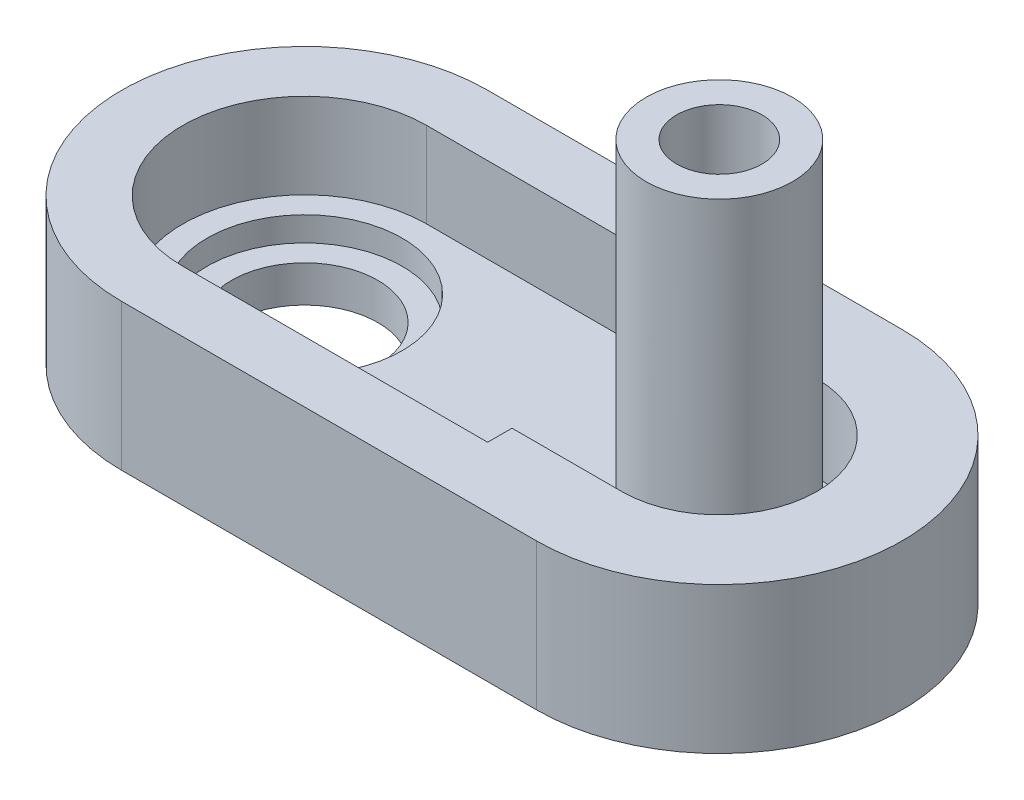
ISO-10303-21;
HEADER;
FILE_DESCRIPTION(('STEP AP214'),'2;1');
FILE_NAME('part.step','',(''),(''),'','','');
FILE_SCHEMA(('AUTOMOTIVE_DESIGN { 1 0 10303 214 1 1 1 1 }'));
ENDSEC;
DATA;
#1=APPLICATION_CONTEXT('core data for automotive mechanical design processes');
#2=APPLICATION_PROTOCOL_DEFINITION('international standard','automotive_design',2000,#1);
#3=PRODUCT_CONTEXT('',#1,'mechanical');
#4=PRODUCT('Part','Part','',(#3));
#5=PRODUCT_RELATED_PRODUCT_CATEGORY('part','',(#4));
#6=PRODUCT_DEFINITION_FORMATION('','',#4);
#7=PRODUCT_DEFINITION_CONTEXT('part definition',#1,'design');
#8=PRODUCT_DEFINITION('design','',#6,#7);
#9=PRODUCT_DEFINITION_SHAPE('','',#8);
#10=(LENGTH_UNIT() NAMED_UNIT(*) SI_UNIT(.MILLI.,.METRE.));
#11=(NAMED_UNIT(*) PLANE_ANGLE_UNIT() SI_UNIT($,.RADIAN.));
#12=(NAMED_UNIT(*) SI_UNIT($,.STERADIAN.) SOLID_ANGLE_UNIT());
#13=UNCERTAINTY_MEASURE_WITH_UNIT(LENGTH_MEASURE(1.E-05),#10,'distance_accuracy_value','');
#14=(GEOMETRIC_REPRESENTATION_CONTEXT(3) GLOBAL_UNCERTAINTY_ASSIGNED_CONTEXT((#13)) GLOBAL_UNIT_ASSIGNED_CONTEXT((#10,
#11,#12)) REPRESENTATION_CONTEXT('',''));
#15=CARTESIAN_POINT('',(0.,0.,0.));
#16=DIRECTION('',(0.,0.,1.));
#17=DIRECTION('',(1.,0.,0.));
#18=AXIS2_PLACEMENT_3D('',#15,#16,#17);
#19=CARTESIAN_POINT('',(-17.,12.,0.));
#20=DIRECTION('',(0.,1.,0.));
#21=DIRECTION('',(0.,0.,1.));
#22=AXIS2_PLACEMENT_3D('',#19,#20,#21);
#23=PLANE('',#22);
#24=CARTESIAN_POINT('',(-17.,12.,0.));
#25=DIRECTION('',(0.,1.,0.));
#26=DIRECTION('',(0.,0.,1.));
#27=AXIS2_PLACEMENT_3D('',#24,#25,#26);
#28=CIRCLE('',#27,15.);
#29=CARTESIAN_POINT('',(-17.,12.,-15.));
#30=VERTEX_POINT('',#29);
#31=CARTESIAN_POINT('',(-17.,12.,15.));
#32=VERTEX_POINT('',#31);
#33=EDGE_CURVE('E165',#30,#32,#28,.T.);
#34=ORIENTED_EDGE('',*,*,#33,.T.);
#35=DIRECTION('',(1.,0.,0.));
#36=VECTOR('',#35,1.);
#37=CARTESIAN_POINT('',(-17.,12.,15.));
#38=LINE('',#37,#36);
#39=CARTESIAN_POINT('',(17.,12.,15.));
#40=VERTEX_POINT('',#39);
#41=EDGE_CURVE('E87',#32,#40,#38,.T.);
#42=ORIENTED_EDGE('',*,*,#41,.T.);
#43=CARTESIAN_POINT('',(17.,12.,0.));
#44=DIRECTION('',(0.,1.,0.));
#45=DIRECTION('',(0.,0.,1.));
#46=AXIS2_PLACEMENT_3D('',#43,#44,#45);
#47=CIRCLE('',#46,15.);
#48=CARTESIAN_POINT('',(17.,12.,-15.));
#49=VERTEX_POINT('',#48);
#50=EDGE_CURVE('E168',#40,#49,#47,.T.);
#51=ORIENTED_EDGE('',*,*,#50,.T.);
#52=DIRECTION('',(-1.,0.,0.));
#53=VECTOR('',#52,1.);
#54=CARTESIAN_POINT('',(-17.,12.,-15.));
#55=LINE('',#54,#53);
#56=EDGE_CURVE('E58',#49,#30,#55,.T.);
#57=ORIENTED_EDGE('',*,*,#56,.T.);
#58=EDGE_LOOP('',(#34,#42,#51,#57));
#59=FACE_BOUND('',#58,.T.);
#60=DIRECTION('',(0.,0.,1.));
#61=VECTOR('',#60,1.);
#62=CARTESIAN_POINT('',(8.00000000000001,12.,8.));
#63=LINE('',#62,#61);
#64=CARTESIAN_POINT('',(8.00000000000001,12.,8.));
#65=VERTEX_POINT('',#64);
#66=CARTESIAN_POINT('',(8.00000000000001,12.,10.));
#67=VERTEX_POINT('',#66);
#68=EDGE_CURVE('E150',#65,#67,#63,.T.);
#69=ORIENTED_EDGE('',*,*,#68,.T.);
#70=DIRECTION('',(-1.,0.,0.));
#71=VECTOR('',#70,1.);
#72=CARTESIAN_POINT('',(8.00000000000001,12.,10.));
#73=LINE('',#72,#71);
#74=CARTESIAN_POINT('',(-17.,12.,10.));
#75=VERTEX_POINT('',#74);
#76=EDGE_CURVE('E49',#67,#75,#73,.T.);
#77=ORIENTED_EDGE('',*,*,#76,.T.);
#78=CARTESIAN_POINT('',(-17.,12.,0.));
#79=DIRECTION('',(0.,-1.,0.));
#80=DIRECTION('',(0.,0.,-1.));
#81=AXIS2_PLACEMENT_3D('',#78,#79,#80);
#82=CIRCLE('',#81,10.);
#83=CARTESIAN_POINT('',(-17.,12.,-10.));
#84=VERTEX_POINT('',#83);
#85=EDGE_CURVE('E154',#75,#84,#82,.T.);
#86=ORIENTED_EDGE('',*,*,#85,.T.);
#87=DIRECTION('',(-1.,0.,0.));
#88=VECTOR('',#87,1.);
#89=CARTESIAN_POINT('',(8.00000000000001,12.,-10.));
#90=LINE('',#89,#88);
#91=CARTESIAN_POINT('',(8.00000000000001,12.,-10.));
#92=VERTEX_POINT('',#91);
#93=EDGE_CURVE('E224',#92,#84,#90,.T.);
#94=ORIENTED_EDGE('',*,*,#93,.F.);
#95=DIRECTION('',(0.,0.,-1.));
#96=VECTOR('',#95,1.);
#97=CARTESIAN_POINT('',(8.00000000000001,12.,-8.));
#98=LINE('',#97,#96);
#99=CARTESIAN_POINT('',(8.00000000000001,12.,-8.));
#100=VERTEX_POINT('',#99);
#101=EDGE_CURVE('E228',#100,#92,#98,.T.);
#102=ORIENTED_EDGE('',*,*,#101,.F.);
#103=DIRECTION('',(1.,0.,0.));
#104=VECTOR('',#103,1.);
#105=CARTESIAN_POINT('',(8.00000000000001,12.,-8.));
#106=LINE('',#105,#104);
#107=CARTESIAN_POINT('',(17.,12.,-8.));
#108=VERTEX_POINT('',#107);
#109=EDGE_CURVE('E232',#100,#108,#106,.T.);
#110=ORIENTED_EDGE('',*,*,#109,.T.);
#111=CARTESIAN_POINT('',(17.,12.,0.));
#112=DIRECTION('',(0.,-1.,0.));
#113=DIRECTION('',(0.,0.,-1.));
#114=AXIS2_PLACEMENT_3D('',#111,#112,#113);
#115=CIRCLE('',#114,8.);
#116=CARTESIAN_POINT('',(17.,12.,7.99999999999999));
#117=VERTEX_POINT('',#116);
#118=EDGE_CURVE('E206',#108,#117,#115,.T.);
#119=ORIENTED_EDGE('',*,*,#118,.T.);
#120=DIRECTION('',(1.,0.,0.));
#121=VECTOR('',#120,1.);
#122=CARTESIAN_POINT('',(8.00000000000001,12.,8.));
#123=LINE('',#122,#121);
#124=EDGE_CURVE('E203',#65,#117,#123,.T.);
#125=ORIENTED_EDGE('',*,*,#124,.F.);
#126=EDGE_LOOP('',(#69,#77,#86,#94,#102,#110,#119,#125));
#127=FACE_BOUND('',#126,.T.);
#128=ADVANCED_FACE('F33',(#59,#127),#23,.T.);
#129=CARTESIAN_POINT('',(-17.,12.,0.));
#130=DIRECTION('',(0.,-1.,0.));
#131=DIRECTION('',(0.,0.,-1.));
#132=AXIS2_PLACEMENT_3D('',#129,#130,#131);
#133=CYLINDRICAL_SURFACE('',#132,15.);
#134=CARTESIAN_POINT('',(-17.,0.,0.));
#135=DIRECTION('',(0.,1.,0.));
#136=DIRECTION('',(0.,0.,1.));
#137=AXIS2_PLACEMENT_3D('',#134,#135,#136);
#138=CIRCLE('',#137,15.);
#139=CARTESIAN_POINT('',(-17.,0.,-15.));
#140=VERTEX_POINT('',#139);
#141=CARTESIAN_POINT('',(-17.,0.,15.));
#142=VERTEX_POINT('',#141);
#143=EDGE_CURVE('E155',#140,#142,#138,.T.);
#144=ORIENTED_EDGE('',*,*,#143,.T.);
#145=DIRECTION('',(0.,-1.,0.));
#146=VECTOR('',#145,1.);
#147=CARTESIAN_POINT('',(-17.,12.,15.));
#148=LINE('',#147,#146);
#149=EDGE_CURVE('E42',#32,#142,#148,.T.);
#150=ORIENTED_EDGE('',*,*,#149,.F.);
#151=ORIENTED_EDGE('',*,*,#33,.F.);
#152=DIRECTION('',(0.,-1.,0.));
#153=VECTOR('',#152,1.);
#154=CARTESIAN_POINT('',(-17.,12.,-15.));
#155=LINE('',#154,#153);
#156=EDGE_CURVE('E170',#30,#140,#155,.T.);
#157=ORIENTED_EDGE('',*,*,#156,.T.);
#158=EDGE_LOOP('',(#144,#150,#151,#157));
#159=FACE_BOUND('',#158,.T.);
#160=ADVANCED_FACE('F35',(#159),#133,.T.);
#161=CARTESIAN_POINT('',(-17.,12.,15.));
#162=DIRECTION('',(0.,0.,-1.));
#163=DIRECTION('',(-1.,0.,0.));
#164=AXIS2_PLACEMENT_3D('',#161,#162,#163);
#165=PLANE('',#164);
#166=DIRECTION('',(1.,0.,0.));
#167=VECTOR('',#166,1.);
#168=CARTESIAN_POINT('',(-17.,0.,15.));
#169=LINE('',#168,#167);
#170=CARTESIAN_POINT('',(17.,0.,15.));
#171=VERTEX_POINT('',#170);
#172=EDGE_CURVE('E159',#142,#171,#169,.T.);
#173=ORIENTED_EDGE('',*,*,#172,.T.);
#174=DIRECTION('',(0.,-1.,0.));
#175=VECTOR('',#174,1.);
#176=CARTESIAN_POINT('',(17.,12.,15.));
#177=LINE('',#176,#175);
#178=EDGE_CURVE('E179',#40,#171,#177,.T.);
#179=ORIENTED_EDGE('',*,*,#178,.F.);
#180=ORIENTED_EDGE('',*,*,#41,.F.);
#181=ORIENTED_EDGE('',*,*,#149,.T.);
#182=EDGE_LOOP('',(#173,#179,#180,#181));
#183=FACE_BOUND('',#182,.T.);
#184=ADVANCED_FACE('F183',(#183),#165,.F.);
#185=CARTESIAN_POINT('',(17.,12.,0.));
#186=DIRECTION('',(0.,-1.,0.));
#187=DIRECTION('',(0.,0.,-1.));
#188=AXIS2_PLACEMENT_3D('',#185,#186,#187);
#189=CYLINDRICAL_SURFACE('',#188,15.);
#190=CARTESIAN_POINT('',(17.,0.,0.));
#191=DIRECTION('',(0.,1.,0.));
#192=DIRECTION('',(0.,0.,1.));
#193=AXIS2_PLACEMENT_3D('',#190,#191,#192);
#194=CIRCLE('',#193,15.);
#195=CARTESIAN_POINT('',(17.,0.,-15.));
#196=VERTEX_POINT('',#195);
#197=EDGE_CURVE('E173',#171,#196,#194,.T.);
#198=ORIENTED_EDGE('',*,*,#197,.T.);
#199=DIRECTION('',(0.,-1.,0.));
#200=VECTOR('',#199,1.);
#201=CARTESIAN_POINT('',(17.,12.,-15.));
#202=LINE('',#201,#200);
#203=EDGE_CURVE('E177',#49,#196,#202,.T.);
#204=ORIENTED_EDGE('',*,*,#203,.F.);
#205=ORIENTED_EDGE('',*,*,#50,.F.);
#206=ORIENTED_EDGE('',*,*,#178,.T.);
#207=EDGE_LOOP('',(#198,#204,#205,#206));
#208=FACE_BOUND('',#207,.T.);
#209=ADVANCED_FACE('F192',(#208),#189,.T.);
#210=CARTESIAN_POINT('',(-17.,12.,-15.));
#211=DIRECTION('',(0.,0.,1.));
#212=DIRECTION('',(1.,0.,0.));
#213=AXIS2_PLACEMENT_3D('',#210,#211,#212);
#214=PLANE('',#213);
#215=DIRECTION('',(-1.,0.,0.));
#216=VECTOR('',#215,1.);
#217=CARTESIAN_POINT('',(-17.,0.,-15.));
#218=LINE('',#217,#216);
#219=EDGE_CURVE('E79',#196,#140,#218,.T.);
#220=ORIENTED_EDGE('',*,*,#219,.T.);
#221=ORIENTED_EDGE('',*,*,#156,.F.);
#222=ORIENTED_EDGE('',*,*,#56,.F.);
#223=ORIENTED_EDGE('',*,*,#203,.T.);
#224=EDGE_LOOP('',(#220,#221,#222,#223));
#225=FACE_BOUND('',#224,.T.);
#226=ADVANCED_FACE('F194',(#225),#214,.F.);
#227=CARTESIAN_POINT('',(-17.,0.,0.));
#228=DIRECTION('',(0.,1.,0.));
#229=DIRECTION('',(0.,0.,1.));
#230=AXIS2_PLACEMENT_3D('',#227,#228,#229);
#231=PLANE('',#230);
#232=CARTESIAN_POINT('',(-17.,0.,0.));
#233=DIRECTION('',(0.,1.,0.));
#234=DIRECTION('',(0.,0.,1.));
#235=AXIS2_PLACEMENT_3D('',#232,#233,#234);
#236=CIRCLE('',#235,6.);
#237=CARTESIAN_POINT('',(-17.,0.,6.));
#238=VERTEX_POINT('',#237);
#239=EDGE_CURVE('E442',#238,#238,#236,.T.);
#240=ORIENTED_EDGE('',*,*,#239,.T.);
#241=EDGE_LOOP('',(#240));
#242=FACE_BOUND('',#241,.T.);
#243=CARTESIAN_POINT('',(17.,0.,0.));
#244=DIRECTION('',(0.,1.,0.));
#245=DIRECTION('',(0.,0.,1.));
#246=AXIS2_PLACEMENT_3D('',#243,#244,#245);
#247=CIRCLE('',#246,3.5);
#248=CARTESIAN_POINT('',(17.,0.,3.5));
#249=VERTEX_POINT('',#248);
#250=EDGE_CURVE('E37',#249,#249,#247,.T.);
#251=ORIENTED_EDGE('',*,*,#250,.T.);
#252=EDGE_LOOP('',(#251));
#253=FACE_BOUND('',#252,.T.);
#254=ORIENTED_EDGE('',*,*,#143,.F.);
#255=ORIENTED_EDGE('',*,*,#219,.F.);
#256=ORIENTED_EDGE('',*,*,#197,.F.);
#257=ORIENTED_EDGE('',*,*,#172,.F.);
#258=EDGE_LOOP('',(#254,#255,#256,#257));
#259=FACE_BOUND('',#258,.T.);
#260=ADVANCED_FACE('F188',(#242,#253,#259),#231,.F.);
#261=CARTESIAN_POINT('',(8.00000000000001,5.,10.));
#262=DIRECTION('',(0.,0.,-1.));
#263=DIRECTION('',(-1.,0.,0.));
#264=AXIS2_PLACEMENT_3D('',#261,#262,#263);
#265=PLANE('',#264);
#266=ORIENTED_EDGE('',*,*,#76,.F.);
#267=DIRECTION('',(0.,1.,0.));
#268=VECTOR('',#267,1.);
#269=CARTESIAN_POINT('',(8.00000000000001,5.,10.));
#270=LINE('',#269,#268);
#271=CARTESIAN_POINT('',(8.00000000000001,5.,10.));
#272=VERTEX_POINT('',#271);
#273=EDGE_CURVE('E149',#272,#67,#270,.T.);
#274=ORIENTED_EDGE('',*,*,#273,.F.);
#275=DIRECTION('',(-1.,0.,0.));
#276=VECTOR('',#275,1.);
#277=CARTESIAN_POINT('',(8.00000000000001,5.,10.));
#278=LINE('',#277,#276);
#279=CARTESIAN_POINT('',(-17.,5.,10.));
#280=VERTEX_POINT('',#279);
#281=EDGE_CURVE('E139',#272,#280,#278,.T.);
#282=ORIENTED_EDGE('',*,*,#281,.T.);
#283=DIRECTION('',(0.,1.,0.));
#284=VECTOR('',#283,1.);
#285=CARTESIAN_POINT('',(-17.,5.,10.));
#286=LINE('',#285,#284);
#287=EDGE_CURVE('E148',#280,#75,#286,.T.);
#288=ORIENTED_EDGE('',*,*,#287,.T.);
#289=EDGE_LOOP('',(#266,#274,#282,#288));
#290=FACE_BOUND('',#289,.T.);
#291=ADVANCED_FACE('F147',(#290),#265,.T.);
#292=CARTESIAN_POINT('',(-17.,5.,0.));
#293=DIRECTION('',(0.,1.,0.));
#294=DIRECTION('',(0.,0.,1.));
#295=AXIS2_PLACEMENT_3D('',#292,#293,#294);
#296=CYLINDRICAL_SURFACE('',#295,10.);
#297=ORIENTED_EDGE('',*,*,#85,.F.);
#298=ORIENTED_EDGE('',*,*,#287,.F.);
#299=CARTESIAN_POINT('',(-17.,5.,0.));
#300=DIRECTION('',(0.,-1.,0.));
#301=DIRECTION('',(0.,0.,-1.));
#302=AXIS2_PLACEMENT_3D('',#299,#300,#301);
#303=CIRCLE('',#302,10.);
#304=CARTESIAN_POINT('',(-17.,5.,-10.));
#305=VERTEX_POINT('',#304);
#306=EDGE_CURVE('E135',#280,#305,#303,.T.);
#307=ORIENTED_EDGE('',*,*,#306,.T.);
#308=DIRECTION('',(0.,1.,0.));
#309=VECTOR('',#308,1.);
#310=CARTESIAN_POINT('',(-17.,5.,-10.));
#311=LINE('',#310,#309);
#312=EDGE_CURVE('E156',#305,#84,#311,.T.);
#313=ORIENTED_EDGE('',*,*,#312,.T.);
#314=EDGE_LOOP('',(#297,#298,#307,#313));
#315=FACE_BOUND('',#314,.T.);
#316=ADVANCED_FACE('F152',(#315),#296,.F.);
#317=CARTESIAN_POINT('',(8.00000000000001,5.,-10.));
#318=DIRECTION('',(0.,0.,-1.));
#319=DIRECTION('',(-1.,0.,0.));
#320=AXIS2_PLACEMENT_3D('',#317,#318,#319);
#321=PLANE('',#320);
#322=ORIENTED_EDGE('',*,*,#93,.T.);
#323=ORIENTED_EDGE('',*,*,#312,.F.);
#324=DIRECTION('',(-1.,0.,0.));
#325=VECTOR('',#324,1.);
#326=CARTESIAN_POINT('',(8.00000000000001,5.,-10.));
#327=LINE('',#326,#325);
#328=CARTESIAN_POINT('',(8.00000000000001,5.,-10.));
#329=VERTEX_POINT('',#328);
#330=EDGE_CURVE('E142',#329,#305,#327,.T.);
#331=ORIENTED_EDGE('',*,*,#330,.F.);
#332=DIRECTION('',(0.,1.,0.));
#333=VECTOR('',#332,1.);
#334=CARTESIAN_POINT('',(8.00000000000001,5.,-10.));
#335=LINE('',#334,#333);
#336=EDGE_CURVE('E161',#329,#92,#335,.T.);
#337=ORIENTED_EDGE('',*,*,#336,.T.);
#338=EDGE_LOOP('',(#322,#323,#331,#337));
#339=FACE_BOUND('',#338,.T.);
#340=ADVANCED_FACE('F222',(#339),#321,.F.);
#341=CARTESIAN_POINT('',(8.00000000000001,5.,-8.));
#342=DIRECTION('',(1.,0.,0.));
#343=DIRECTION('',(0.,0.,-1.));
#344=AXIS2_PLACEMENT_3D('',#341,#342,#343);
#345=PLANE('',#344);
#346=ORIENTED_EDGE('',*,*,#101,.T.);
#347=ORIENTED_EDGE('',*,*,#336,.F.);
#348=DIRECTION('',(0.,0.,-1.));
#349=VECTOR('',#348,1.);
#350=CARTESIAN_POINT('',(8.00000000000001,5.,-8.));
#351=LINE('',#350,#349);
#352=CARTESIAN_POINT('',(8.00000000000001,5.,-8.));
#353=VERTEX_POINT('',#352);
#354=EDGE_CURVE('E265',#353,#329,#351,.T.);
#355=ORIENTED_EDGE('',*,*,#354,.F.);
#356=DIRECTION('',(0.,1.,0.));
#357=VECTOR('',#356,1.);
#358=CARTESIAN_POINT('',(8.00000000000001,5.,-8.));
#359=LINE('',#358,#357);
#360=EDGE_CURVE('E218',#353,#100,#359,.T.);
#361=ORIENTED_EDGE('',*,*,#360,.T.);
#362=EDGE_LOOP('',(#346,#347,#355,#361));
#363=FACE_BOUND('',#362,.T.);
#364=ADVANCED_FACE('F229',(#363),#345,.F.);
#365=CARTESIAN_POINT('',(8.00000000000001,5.,-8.));
#366=DIRECTION('',(0.,0.,1.));
#367=DIRECTION('',(1.,0.,0.));
#368=AXIS2_PLACEMENT_3D('',#365,#366,#367);
#369=PLANE('',#368);
#370=ORIENTED_EDGE('',*,*,#109,.F.);
#371=ORIENTED_EDGE('',*,*,#360,.F.);
#372=DIRECTION('',(1.,0.,0.));
#373=VECTOR('',#372,1.);
#374=CARTESIAN_POINT('',(8.00000000000001,5.,-8.));
#375=LINE('',#374,#373);
#376=CARTESIAN_POINT('',(17.,5.,-8.));
#377=VERTEX_POINT('',#376);
#378=EDGE_CURVE('E267',#353,#377,#375,.T.);
#379=ORIENTED_EDGE('',*,*,#378,.T.);
#380=DIRECTION('',(0.,1.,0.));
#381=VECTOR('',#380,1.);
#382=CARTESIAN_POINT('',(17.,5.,-8.));
#383=LINE('',#382,#381);
#384=EDGE_CURVE('E216',#377,#108,#383,.T.);
#385=ORIENTED_EDGE('',*,*,#384,.T.);
#386=EDGE_LOOP('',(#370,#371,#379,#385));
#387=FACE_BOUND('',#386,.T.);
#388=ADVANCED_FACE('F270',(#387),#369,.T.);
#389=CARTESIAN_POINT('',(17.,5.,0.));
#390=DIRECTION('',(0.,1.,0.));
#391=DIRECTION('',(0.,0.,1.));
#392=AXIS2_PLACEMENT_3D('',#389,#390,#391);
#393=CYLINDRICAL_SURFACE('',#392,8.);
#394=ORIENTED_EDGE('',*,*,#118,.F.);
#395=ORIENTED_EDGE('',*,*,#384,.F.);
#396=CARTESIAN_POINT('',(17.,5.,0.));
#397=DIRECTION('',(0.,-1.,0.));
#398=DIRECTION('',(0.,0.,-1.));
#399=AXIS2_PLACEMENT_3D('',#396,#397,#398);
#400=CIRCLE('',#399,8.);
#401=CARTESIAN_POINT('',(17.,5.,7.99999999999999));
#402=VERTEX_POINT('',#401);
#403=EDGE_CURVE('E244',#377,#402,#400,.T.);
#404=ORIENTED_EDGE('',*,*,#403,.T.);
#405=DIRECTION('',(0.,1.,0.));
#406=VECTOR('',#405,1.);
#407=CARTESIAN_POINT('',(17.,5.,7.99999999999999));
#408=LINE('',#407,#406);
#409=EDGE_CURVE('E214',#402,#117,#408,.T.);
#410=ORIENTED_EDGE('',*,*,#409,.T.);
#411=EDGE_LOOP('',(#394,#395,#404,#410));
#412=FACE_BOUND('',#411,.T.);
#413=ADVANCED_FACE('F241',(#412),#393,.F.);
#414=CARTESIAN_POINT('',(8.00000000000001,5.,8.));
#415=DIRECTION('',(0.,0.,1.));
#416=DIRECTION('',(1.,0.,0.));
#417=AXIS2_PLACEMENT_3D('',#414,#415,#416);
#418=PLANE('',#417);
#419=ORIENTED_EDGE('',*,*,#124,.T.);
#420=ORIENTED_EDGE('',*,*,#409,.F.);
#421=DIRECTION('',(1.,0.,0.));
#422=VECTOR('',#421,1.);
#423=CARTESIAN_POINT('',(8.00000000000001,5.,8.));
#424=LINE('',#423,#422);
#425=CARTESIAN_POINT('',(8.00000000000001,5.,8.));
#426=VERTEX_POINT('',#425);
#427=EDGE_CURVE('E249',#426,#402,#424,.T.);
#428=ORIENTED_EDGE('',*,*,#427,.F.);
#429=DIRECTION('',(0.,1.,0.));
#430=VECTOR('',#429,1.);
#431=CARTESIAN_POINT('',(8.00000000000001,5.,8.));
#432=LINE('',#431,#430);
#433=EDGE_CURVE('E211',#426,#65,#432,.T.);
#434=ORIENTED_EDGE('',*,*,#433,.T.);
#435=EDGE_LOOP('',(#419,#420,#428,#434));
#436=FACE_BOUND('',#435,.T.);
#437=ADVANCED_FACE('F248',(#436),#418,.F.);
#438=CARTESIAN_POINT('',(8.00000000000001,5.,8.));
#439=DIRECTION('',(-1.,0.,0.));
#440=DIRECTION('',(0.,0.,1.));
#441=AXIS2_PLACEMENT_3D('',#438,#439,#440);
#442=PLANE('',#441);
#443=ORIENTED_EDGE('',*,*,#68,.F.);
#444=ORIENTED_EDGE('',*,*,#433,.F.);
#445=DIRECTION('',(0.,0.,1.));
#446=VECTOR('',#445,1.);
#447=CARTESIAN_POINT('',(8.00000000000001,5.,8.));
#448=LINE('',#447,#446);
#449=EDGE_CURVE('E212',#426,#272,#448,.T.);
#450=ORIENTED_EDGE('',*,*,#449,.T.);
#451=ORIENTED_EDGE('',*,*,#273,.T.);
#452=EDGE_LOOP('',(#443,#444,#450,#451));
#453=FACE_BOUND('',#452,.T.);
#454=ADVANCED_FACE('F250',(#453),#442,.T.);
#455=CARTESIAN_POINT('',(-17.,5.,0.));
#456=DIRECTION('',(0.,-1.,0.));
#457=DIRECTION('',(0.,0.,-1.));
#458=AXIS2_PLACEMENT_3D('',#455,#456,#457);
#459=PLANE('',#458);
#460=CARTESIAN_POINT('',(-17.,5.,0.));
#461=DIRECTION('',(0.,1.,0.));
#462=DIRECTION('',(0.,0.,1.));
#463=AXIS2_PLACEMENT_3D('',#460,#461,#462);
#464=CIRCLE('',#463,8.);
#465=CARTESIAN_POINT('',(-17.,5.,8.));
#466=VERTEX_POINT('',#465);
#467=EDGE_CURVE('E444',#466,#466,#464,.T.);
#468=ORIENTED_EDGE('',*,*,#467,.F.);
#469=EDGE_LOOP('',(#468));
#470=FACE_BOUND('',#469,.T.);
#471=CARTESIAN_POINT('',(17.,5.,0.));
#472=DIRECTION('',(0.,-1.,0.));
#473=DIRECTION('',(0.,0.,-1.));
#474=AXIS2_PLACEMENT_3D('',#471,#472,#473);
#475=CIRCLE('',#474,6.);
#476=CARTESIAN_POINT('',(17.,5.,-6.));
#477=VERTEX_POINT('',#476);
#478=EDGE_CURVE('E11',#477,#477,#475,.F.);
#479=ORIENTED_EDGE('',*,*,#478,.F.);
#480=EDGE_LOOP('',(#479));
#481=FACE_BOUND('',#480,.T.);
#482=ORIENTED_EDGE('',*,*,#281,.F.);
#483=ORIENTED_EDGE('',*,*,#449,.F.);
#484=ORIENTED_EDGE('',*,*,#427,.T.);
#485=ORIENTED_EDGE('',*,*,#403,.F.);
#486=ORIENTED_EDGE('',*,*,#378,.F.);
#487=ORIENTED_EDGE('',*,*,#354,.T.);
#488=ORIENTED_EDGE('',*,*,#330,.T.);
#489=ORIENTED_EDGE('',*,*,#306,.F.);
#490=EDGE_LOOP('',(#482,#483,#484,#485,#486,#487,#488,#489));
#491=FACE_BOUND('',#490,.T.);
#492=ADVANCED_FACE('F137',(#470,#481,#491),#459,.F.);
#493=CARTESIAN_POINT('',(17.,33.,0.));
#494=DIRECTION('',(0.,1.,0.));
#495=DIRECTION('',(0.,0.,1.));
#496=AXIS2_PLACEMENT_3D('',#493,#494,#495);
#497=PLANE('',#496);
#498=CARTESIAN_POINT('',(17.,33.,0.));
#499=DIRECTION('',(0.,1.,0.));
#500=DIRECTION('',(0.,0.,1.));
#501=AXIS2_PLACEMENT_3D('',#498,#499,#500);
#502=CIRCLE('',#501,6.);
#503=CARTESIAN_POINT('',(17.,33.,5.99999999999999));
#504=VERTEX_POINT('',#503);
#505=EDGE_CURVE('E254',#504,#504,#502,.T.);
#506=ORIENTED_EDGE('',*,*,#505,.T.);
#507=EDGE_LOOP('',(#506));
#508=FACE_BOUND('',#507,.T.);
#509=CARTESIAN_POINT('',(17.,33.,0.));
#510=DIRECTION('',(0.,1.,0.));
#511=DIRECTION('',(0.,0.,1.));
#512=AXIS2_PLACEMENT_3D('',#509,#510,#511);
#513=CIRCLE('',#512,3.5);
#514=CARTESIAN_POINT('',(17.,33.,3.5));
#515=VERTEX_POINT('',#514);
#516=EDGE_CURVE('E256',#515,#515,#513,.T.);
#517=ORIENTED_EDGE('',*,*,#516,.F.);
#518=EDGE_LOOP('',(#517));
#519=FACE_BOUND('',#518,.T.);
#520=ADVANCED_FACE('F364',(#508,#519),#497,.T.);
#521=CARTESIAN_POINT('',(17.,33.,0.));
#522=DIRECTION('',(0.,-1.,0.));
#523=DIRECTION('',(0.,0.,-1.));
#524=AXIS2_PLACEMENT_3D('',#521,#522,#523);
#525=CYLINDRICAL_SURFACE('',#524,6.);
#526=ORIENTED_EDGE('',*,*,#505,.F.);
#527=EDGE_LOOP('',(#526));
#528=FACE_BOUND('',#527,.T.);
#529=ORIENTED_EDGE('',*,*,#478,.T.);
#530=EDGE_LOOP('',(#529));
#531=FACE_BOUND('',#530,.T.);
#532=ADVANCED_FACE('F369',(#528,#531),#525,.T.);
#533=CARTESIAN_POINT('',(17.,33.,0.));
#534=DIRECTION('',(0.,-1.,0.));
#535=DIRECTION('',(0.,0.,-1.));
#536=AXIS2_PLACEMENT_3D('',#533,#534,#535);
#537=CYLINDRICAL_SURFACE('',#536,3.5);
#538=ORIENTED_EDGE('',*,*,#516,.T.);
#539=EDGE_LOOP('',(#538));
#540=FACE_BOUND('',#539,.T.);
#541=ORIENTED_EDGE('',*,*,#250,.F.);
#542=EDGE_LOOP('',(#541));
#543=FACE_BOUND('',#542,.T.);
#544=ADVANCED_FACE('F378',(#540,#543),#537,.F.);
#545=CARTESIAN_POINT('',(-17.,3.,0.));
#546=DIRECTION('',(0.,1.,0.));
#547=DIRECTION('',(0.,0.,1.));
#548=AXIS2_PLACEMENT_3D('',#545,#546,#547);
#549=CYLINDRICAL_SURFACE('',#548,8.);
#550=CARTESIAN_POINT('',(-17.,3.,0.));
#551=DIRECTION('',(0.,1.,0.));
#552=DIRECTION('',(0.,0.,1.));
#553=AXIS2_PLACEMENT_3D('',#550,#551,#552);
#554=CIRCLE('',#553,8.);
#555=CARTESIAN_POINT('',(-17.,3.,8.));
#556=VERTEX_POINT('',#555);
#557=EDGE_CURVE('E447',#556,#556,#554,.T.);
#558=ORIENTED_EDGE('',*,*,#557,.F.);
#559=EDGE_LOOP('',(#558));
#560=FACE_BOUND('',#559,.T.);
#561=ORIENTED_EDGE('',*,*,#467,.T.);
#562=EDGE_LOOP('',(#561));
#563=FACE_BOUND('',#562,.T.);
#564=ADVANCED_FACE('F389',(#560,#563),#549,.F.);
#565=CARTESIAN_POINT('',(0.,3.,0.));
#566=DIRECTION('',(0.,1.,0.));
#567=DIRECTION('',(0.,0.,1.));
#568=AXIS2_PLACEMENT_3D('',#565,#566,#567);
#569=PLANE('',#568);
#570=CARTESIAN_POINT('',(-17.,3.,0.));
#571=DIRECTION('',(0.,1.,0.));
#572=DIRECTION('',(0.,0.,1.));
#573=AXIS2_PLACEMENT_3D('',#570,#571,#572);
#574=CIRCLE('',#573,6.);
#575=CARTESIAN_POINT('',(-17.,3.,6.));
#576=VERTEX_POINT('',#575);
#577=EDGE_CURVE('E439',#576,#576,#574,.T.);
#578=ORIENTED_EDGE('',*,*,#577,.F.);
#579=EDGE_LOOP('',(#578));
#580=FACE_BOUND('',#579,.T.);
#581=ORIENTED_EDGE('',*,*,#557,.T.);
#582=EDGE_LOOP('',(#581));
#583=FACE_BOUND('',#582,.T.);
#584=ADVANCED_FACE('F406',(#580,#583),#569,.T.);
#585=CARTESIAN_POINT('',(-17.,0.,0.));
#586=DIRECTION('',(0.,1.,0.));
#587=DIRECTION('',(0.,0.,1.));
#588=AXIS2_PLACEMENT_3D('',#585,#586,#587);
#589=CYLINDRICAL_SURFACE('',#588,6.);
#590=ORIENTED_EDGE('',*,*,#577,.T.);
#591=EDGE_LOOP('',(#590));
#592=FACE_BOUND('',#591,.T.);
#593=ORIENTED_EDGE('',*,*,#239,.F.);
#594=EDGE_LOOP('',(#593));
#595=FACE_BOUND('',#594,.T.);
#596=ADVANCED_FACE('F417',(#592,#595),#589,.F.);
#597=CLOSED_SHELL('',(#128,#160,#184,#209,#226,#260,#291,#316,#340,#364,#388,#413,#437,#454,
#492,#520,#532,#544,#564,#584,#596));
#598=MANIFOLD_SOLID_BREP('B2',#597);
#599=ADVANCED_BREP_SHAPE_REPRESENTATION('',(#18,#598),#14);
#600=SHAPE_DEFINITION_REPRESENTATION(#9,#599);
ENDSEC;
END-ISO-10303-21;
